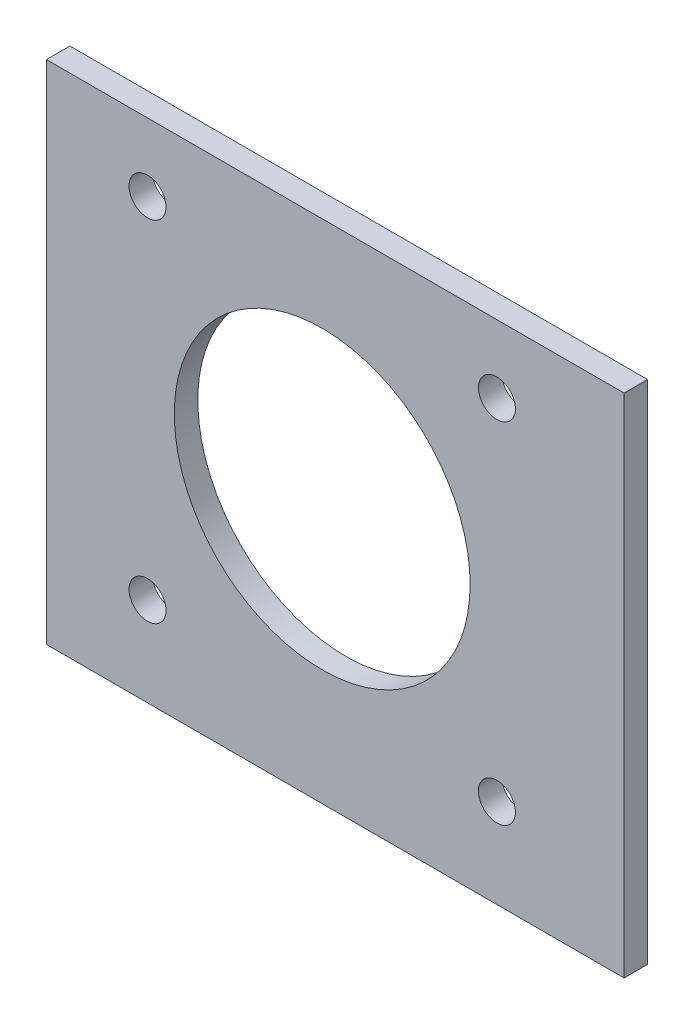
ISO-10303-21;
HEADER;
FILE_DESCRIPTION(('STEP AP214'),'2;1');
FILE_NAME('part.step','',(''),(''),'','','');
FILE_SCHEMA(('AUTOMOTIVE_DESIGN { 1 0 10303 214 1 1 1 1 }'));
ENDSEC;
DATA;
#1=APPLICATION_CONTEXT('core data for automotive mechanical design processes');
#2=APPLICATION_PROTOCOL_DEFINITION('international standard','automotive_design',2000,#1);
#3=PRODUCT_CONTEXT('',#1,'mechanical');
#4=PRODUCT('Part','Part','',(#3));
#5=PRODUCT_RELATED_PRODUCT_CATEGORY('part','',(#4));
#6=PRODUCT_DEFINITION_FORMATION('','',#4);
#7=PRODUCT_DEFINITION_CONTEXT('part definition',#1,'design');
#8=PRODUCT_DEFINITION('design','',#6,#7);
#9=PRODUCT_DEFINITION_SHAPE('','',#8);
#10=(LENGTH_UNIT() NAMED_UNIT(*) SI_UNIT(.MILLI.,.METRE.));
#11=(NAMED_UNIT(*) PLANE_ANGLE_UNIT() SI_UNIT($,.RADIAN.));
#12=(NAMED_UNIT(*) SI_UNIT($,.STERADIAN.) SOLID_ANGLE_UNIT());
#13=UNCERTAINTY_MEASURE_WITH_UNIT(LENGTH_MEASURE(1.E-05),#10,'distance_accuracy_value','');
#14=(GEOMETRIC_REPRESENTATION_CONTEXT(3) GLOBAL_UNCERTAINTY_ASSIGNED_CONTEXT((#13)) GLOBAL_UNIT_ASSIGNED_CONTEXT((#10,
#11,#12)) REPRESENTATION_CONTEXT('',''));
#15=CARTESIAN_POINT('',(0.,0.,0.));
#16=DIRECTION('',(0.,0.,1.));
#17=DIRECTION('',(1.,0.,0.));
#18=AXIS2_PLACEMENT_3D('',#15,#16,#17);
#19=CARTESIAN_POINT('',(-37.2955274692117,-35.6729857622042,3.175));
#20=DIRECTION('',(0.,0.,1.));
#21=DIRECTION('',(1.,0.,0.));
#22=AXIS2_PLACEMENT_3D('',#19,#20,#21);
#23=PLANE('',#22);
#24=CARTESIAN_POINT('',(-23.622,-23.622,3.175));
#25=DIRECTION('',(0.,0.,1.));
#26=DIRECTION('',(1.,0.,0.));
#27=AXIS2_PLACEMENT_3D('',#24,#25,#26);
#28=CIRCLE('',#27,2.5);
#29=CARTESIAN_POINT('',(-21.122,-23.622,3.175));
#30=VERTEX_POINT('',#29);
#31=EDGE_CURVE('E127',#30,#30,#28,.T.);
#32=ORIENTED_EDGE('',*,*,#31,.F.);
#33=EDGE_LOOP('',(#32));
#34=FACE_BOUND('',#33,.T.);
#35=CARTESIAN_POINT('',(-23.622,23.622,3.175));
#36=DIRECTION('',(0.,0.,1.));
#37=DIRECTION('',(1.,0.,0.));
#38=AXIS2_PLACEMENT_3D('',#35,#36,#37);
#39=CIRCLE('',#38,2.5);
#40=CARTESIAN_POINT('',(-21.122,23.622,3.175));
#41=VERTEX_POINT('',#40);
#42=EDGE_CURVE('E115',#41,#41,#39,.T.);
#43=ORIENTED_EDGE('',*,*,#42,.F.);
#44=EDGE_LOOP('',(#43));
#45=FACE_BOUND('',#44,.T.);
#46=DIRECTION('',(0.,-1.,0.));
#47=VECTOR('',#46,1.);
#48=CARTESIAN_POINT('',(-37.2955274692117,32.8191971347565,3.175));
#49=LINE('',#48,#47);
#50=CARTESIAN_POINT('',(-37.2955274692117,32.8191971347565,3.175));
#51=VERTEX_POINT('',#50);
#52=CARTESIAN_POINT('',(-37.2955274692117,-35.6729857622042,3.175));
#53=VERTEX_POINT('',#52);
#54=EDGE_CURVE('E85',#51,#53,#49,.T.);
#55=ORIENTED_EDGE('',*,*,#54,.T.);
#56=DIRECTION('',(1.,0.,0.));
#57=VECTOR('',#56,1.);
#58=CARTESIAN_POINT('',(-37.2955274692117,-35.6729857622042,3.175));
#59=LINE('',#58,#57);
#60=CARTESIAN_POINT('',(40.821549654197,-35.6729857622042,3.175));
#61=VERTEX_POINT('',#60);
#62=EDGE_CURVE('E80',#53,#61,#59,.T.);
#63=ORIENTED_EDGE('',*,*,#62,.T.);
#64=DIRECTION('',(0.,1.,0.));
#65=VECTOR('',#64,1.);
#66=CARTESIAN_POINT('',(40.821549654197,32.8191971347565,3.175));
#67=LINE('',#66,#65);
#68=CARTESIAN_POINT('',(40.821549654197,32.8191971347565,3.175));
#69=VERTEX_POINT('',#68);
#70=EDGE_CURVE('E83',#61,#69,#67,.T.);
#71=ORIENTED_EDGE('',*,*,#70,.T.);
#72=DIRECTION('',(-1.,0.,0.));
#73=VECTOR('',#72,1.);
#74=CARTESIAN_POINT('',(-37.2955274692117,32.8191971347565,3.175));
#75=LINE('',#74,#73);
#76=EDGE_CURVE('E50',#69,#51,#75,.T.);
#77=ORIENTED_EDGE('',*,*,#76,.T.);
#78=EDGE_LOOP('',(#55,#63,#71,#77));
#79=FACE_BOUND('',#78,.T.);
#80=CARTESIAN_POINT('',(0.,0.,3.175));
#81=DIRECTION('',(0.,0.,1.));
#82=DIRECTION('',(1.,0.,0.));
#83=AXIS2_PLACEMENT_3D('',#80,#81,#82);
#84=CIRCLE('',#83,20.);
#85=CARTESIAN_POINT('',(20.,0.,3.175));
#86=VERTEX_POINT('',#85);
#87=EDGE_CURVE('E100',#86,#86,#84,.T.);
#88=ORIENTED_EDGE('',*,*,#87,.F.);
#89=EDGE_LOOP('',(#88));
#90=FACE_BOUND('',#89,.T.);
#91=CARTESIAN_POINT('',(23.622,23.622,3.175));
#92=DIRECTION('',(0.,0.,1.));
#93=DIRECTION('',(1.,0.,0.));
#94=AXIS2_PLACEMENT_3D('',#91,#92,#93);
#95=CIRCLE('',#94,2.5);
#96=CARTESIAN_POINT('',(26.122,23.622,3.175));
#97=VERTEX_POINT('',#96);
#98=EDGE_CURVE('E121',#97,#97,#95,.T.);
#99=ORIENTED_EDGE('',*,*,#98,.F.);
#100=EDGE_LOOP('',(#99));
#101=FACE_BOUND('',#100,.T.);
#102=CARTESIAN_POINT('',(23.622,-23.622,3.175));
#103=DIRECTION('',(0.,0.,1.));
#104=DIRECTION('',(1.,0.,0.));
#105=AXIS2_PLACEMENT_3D('',#102,#103,#104);
#106=CIRCLE('',#105,2.5);
#107=CARTESIAN_POINT('',(26.122,-23.622,3.175));
#108=VERTEX_POINT('',#107);
#109=EDGE_CURVE('E133',#108,#108,#106,.T.);
#110=ORIENTED_EDGE('',*,*,#109,.F.);
#111=EDGE_LOOP('',(#110));
#112=FACE_BOUND('',#111,.T.);
#113=ADVANCED_FACE('F33',(#34,#45,#79,#90,#101,#112),#23,.T.);
#114=CARTESIAN_POINT('',(-37.2955274692117,-35.6729857622042,0.));
#115=DIRECTION('',(0.,0.,1.));
#116=DIRECTION('',(1.,0.,0.));
#117=AXIS2_PLACEMENT_3D('',#114,#115,#116);
#118=PLANE('',#117);
#119=CARTESIAN_POINT('',(-23.622,-23.622,0.));
#120=DIRECTION('',(0.,0.,1.));
#121=DIRECTION('',(1.,0.,0.));
#122=AXIS2_PLACEMENT_3D('',#119,#120,#121);
#123=CIRCLE('',#122,2.5);
#124=CARTESIAN_POINT('',(-21.122,-23.622,0.));
#125=VERTEX_POINT('',#124);
#126=EDGE_CURVE('E130',#125,#125,#123,.T.);
#127=ORIENTED_EDGE('',*,*,#126,.T.);
#128=EDGE_LOOP('',(#127));
#129=FACE_BOUND('',#128,.T.);
#130=CARTESIAN_POINT('',(-23.622,23.622,0.));
#131=DIRECTION('',(0.,0.,1.));
#132=DIRECTION('',(1.,0.,0.));
#133=AXIS2_PLACEMENT_3D('',#130,#131,#132);
#134=CIRCLE('',#133,2.5);
#135=CARTESIAN_POINT('',(-21.122,23.622,0.));
#136=VERTEX_POINT('',#135);
#137=EDGE_CURVE('E118',#136,#136,#134,.T.);
#138=ORIENTED_EDGE('',*,*,#137,.T.);
#139=EDGE_LOOP('',(#138));
#140=FACE_BOUND('',#139,.T.);
#141=DIRECTION('',(0.,-1.,0.));
#142=VECTOR('',#141,1.);
#143=CARTESIAN_POINT('',(-37.2955274692117,32.8191971347565,0.));
#144=LINE('',#143,#142);
#145=CARTESIAN_POINT('',(-37.2955274692117,32.8191971347565,0.));
#146=VERTEX_POINT('',#145);
#147=CARTESIAN_POINT('',(-37.2955274692117,-35.6729857622042,0.));
#148=VERTEX_POINT('',#147);
#149=EDGE_CURVE('E97',#146,#148,#144,.T.);
#150=ORIENTED_EDGE('',*,*,#149,.F.);
#151=DIRECTION('',(-1.,0.,0.));
#152=VECTOR('',#151,1.);
#153=CARTESIAN_POINT('',(-37.2955274692117,32.8191971347565,0.));
#154=LINE('',#153,#152);
#155=CARTESIAN_POINT('',(40.821549654197,32.8191971347565,0.));
#156=VERTEX_POINT('',#155);
#157=EDGE_CURVE('E73',#156,#146,#154,.T.);
#158=ORIENTED_EDGE('',*,*,#157,.F.);
#159=DIRECTION('',(0.,1.,0.));
#160=VECTOR('',#159,1.);
#161=CARTESIAN_POINT('',(40.821549654197,32.8191971347565,0.));
#162=LINE('',#161,#160);
#163=CARTESIAN_POINT('',(40.821549654197,-35.6729857622042,0.));
#164=VERTEX_POINT('',#163);
#165=EDGE_CURVE('E67',#164,#156,#162,.T.);
#166=ORIENTED_EDGE('',*,*,#165,.F.);
#167=DIRECTION('',(1.,0.,0.));
#168=VECTOR('',#167,1.);
#169=CARTESIAN_POINT('',(-37.2955274692117,-35.6729857622042,0.));
#170=LINE('',#169,#168);
#171=EDGE_CURVE('E89',#148,#164,#170,.T.);
#172=ORIENTED_EDGE('',*,*,#171,.F.);
#173=EDGE_LOOP('',(#150,#158,#166,#172));
#174=FACE_BOUND('',#173,.T.);
#175=CARTESIAN_POINT('',(0.,0.,0.));
#176=DIRECTION('',(0.,0.,1.));
#177=DIRECTION('',(1.,0.,0.));
#178=AXIS2_PLACEMENT_3D('',#175,#176,#177);
#179=CIRCLE('',#178,20.);
#180=CARTESIAN_POINT('',(20.,0.,0.));
#181=VERTEX_POINT('',#180);
#182=EDGE_CURVE('E112',#181,#181,#179,.T.);
#183=ORIENTED_EDGE('',*,*,#182,.T.);
#184=EDGE_LOOP('',(#183));
#185=FACE_BOUND('',#184,.T.);
#186=CARTESIAN_POINT('',(23.622,23.622,0.));
#187=DIRECTION('',(0.,0.,1.));
#188=DIRECTION('',(1.,0.,0.));
#189=AXIS2_PLACEMENT_3D('',#186,#187,#188);
#190=CIRCLE('',#189,2.5);
#191=CARTESIAN_POINT('',(26.122,23.622,0.));
#192=VERTEX_POINT('',#191);
#193=EDGE_CURVE('E124',#192,#192,#190,.T.);
#194=ORIENTED_EDGE('',*,*,#193,.T.);
#195=EDGE_LOOP('',(#194));
#196=FACE_BOUND('',#195,.T.);
#197=CARTESIAN_POINT('',(23.622,-23.622,0.));
#198=DIRECTION('',(0.,0.,1.));
#199=DIRECTION('',(1.,0.,0.));
#200=AXIS2_PLACEMENT_3D('',#197,#198,#199);
#201=CIRCLE('',#200,2.5);
#202=CARTESIAN_POINT('',(26.122,-23.622,0.));
#203=VERTEX_POINT('',#202);
#204=EDGE_CURVE('E136',#203,#203,#201,.T.);
#205=ORIENTED_EDGE('',*,*,#204,.T.);
#206=EDGE_LOOP('',(#205));
#207=FACE_BOUND('',#206,.T.);
#208=ADVANCED_FACE('F108',(#129,#140,#174,#185,#196,#207),#118,.F.);
#209=CARTESIAN_POINT('',(-37.2955274692117,32.8191971347565,3.175));
#210=DIRECTION('',(1.,0.,0.));
#211=DIRECTION('',(0.,0.,-1.));
#212=AXIS2_PLACEMENT_3D('',#209,#210,#211);
#213=PLANE('',#212);
#214=ORIENTED_EDGE('',*,*,#149,.T.);
#215=DIRECTION('',(0.,0.,-1.));
#216=VECTOR('',#215,1.);
#217=CARTESIAN_POINT('',(-37.2955274692117,-35.6729857622042,3.175));
#218=LINE('',#217,#216);
#219=EDGE_CURVE('E11',#53,#148,#218,.T.);
#220=ORIENTED_EDGE('',*,*,#219,.F.);
#221=ORIENTED_EDGE('',*,*,#54,.F.);
#222=DIRECTION('',(0.,0.,-1.));
#223=VECTOR('',#222,1.);
#224=CARTESIAN_POINT('',(-37.2955274692117,32.8191971347565,3.175));
#225=LINE('',#224,#223);
#226=EDGE_CURVE('E93',#51,#146,#225,.T.);
#227=ORIENTED_EDGE('',*,*,#226,.T.);
#228=EDGE_LOOP('',(#214,#220,#221,#227));
#229=FACE_BOUND('',#228,.T.);
#230=ADVANCED_FACE('F35',(#229),#213,.F.);
#231=CARTESIAN_POINT('',(-37.2955274692117,-35.6729857622042,3.175));
#232=DIRECTION('',(0.,1.,0.));
#233=DIRECTION('',(0.,0.,1.));
#234=AXIS2_PLACEMENT_3D('',#231,#232,#233);
#235=PLANE('',#234);
#236=ORIENTED_EDGE('',*,*,#171,.T.);
#237=DIRECTION('',(0.,0.,-1.));
#238=VECTOR('',#237,1.);
#239=CARTESIAN_POINT('',(40.821549654197,-35.6729857622042,3.175));
#240=LINE('',#239,#238);
#241=EDGE_CURVE('E42',#61,#164,#240,.T.);
#242=ORIENTED_EDGE('',*,*,#241,.F.);
#243=ORIENTED_EDGE('',*,*,#62,.F.);
#244=ORIENTED_EDGE('',*,*,#219,.T.);
#245=EDGE_LOOP('',(#236,#242,#243,#244));
#246=FACE_BOUND('',#245,.T.);
#247=ADVANCED_FACE('F88',(#246),#235,.F.);
#248=CARTESIAN_POINT('',(40.821549654197,32.8191971347565,3.175));
#249=DIRECTION('',(-1.,0.,0.));
#250=DIRECTION('',(0.,0.,1.));
#251=AXIS2_PLACEMENT_3D('',#248,#249,#250);
#252=PLANE('',#251);
#253=ORIENTED_EDGE('',*,*,#165,.T.);
#254=DIRECTION('',(0.,0.,-1.));
#255=VECTOR('',#254,1.);
#256=CARTESIAN_POINT('',(40.821549654197,32.8191971347565,3.175));
#257=LINE('',#256,#255);
#258=EDGE_CURVE('E90',#69,#156,#257,.T.);
#259=ORIENTED_EDGE('',*,*,#258,.F.);
#260=ORIENTED_EDGE('',*,*,#70,.F.);
#261=ORIENTED_EDGE('',*,*,#241,.T.);
#262=EDGE_LOOP('',(#253,#259,#260,#261));
#263=FACE_BOUND('',#262,.T.);
#264=ADVANCED_FACE('F91',(#263),#252,.F.);
#265=CARTESIAN_POINT('',(-37.2955274692117,32.8191971347565,3.175));
#266=DIRECTION('',(0.,-1.,0.));
#267=DIRECTION('',(0.,0.,-1.));
#268=AXIS2_PLACEMENT_3D('',#265,#266,#267);
#269=PLANE('',#268);
#270=ORIENTED_EDGE('',*,*,#157,.T.);
#271=ORIENTED_EDGE('',*,*,#226,.F.);
#272=ORIENTED_EDGE('',*,*,#76,.F.);
#273=ORIENTED_EDGE('',*,*,#258,.T.);
#274=EDGE_LOOP('',(#270,#271,#272,#273));
#275=FACE_BOUND('',#274,.T.);
#276=ADVANCED_FACE('F105',(#275),#269,.F.);
#277=CARTESIAN_POINT('',(0.,0.,3.175));
#278=DIRECTION('',(0.,0.,-1.));
#279=DIRECTION('',(-1.,0.,0.));
#280=AXIS2_PLACEMENT_3D('',#277,#278,#279);
#281=CYLINDRICAL_SURFACE('',#280,20.);
#282=ORIENTED_EDGE('',*,*,#87,.T.);
#283=EDGE_LOOP('',(#282));
#284=FACE_BOUND('',#283,.T.);
#285=ORIENTED_EDGE('',*,*,#182,.F.);
#286=EDGE_LOOP('',(#285));
#287=FACE_BOUND('',#286,.T.);
#288=ADVANCED_FACE('F156',(#284,#287),#281,.F.);
#289=CARTESIAN_POINT('',(-23.622,23.622,3.175));
#290=DIRECTION('',(0.,0.,-1.));
#291=DIRECTION('',(-1.,0.,0.));
#292=AXIS2_PLACEMENT_3D('',#289,#290,#291);
#293=CYLINDRICAL_SURFACE('',#292,2.5);
#294=ORIENTED_EDGE('',*,*,#42,.T.);
#295=EDGE_LOOP('',(#294));
#296=FACE_BOUND('',#295,.T.);
#297=ORIENTED_EDGE('',*,*,#137,.F.);
#298=EDGE_LOOP('',(#297));
#299=FACE_BOUND('',#298,.T.);
#300=ADVANCED_FACE('F210',(#296,#299),#293,.F.);
#301=CARTESIAN_POINT('',(23.622,23.622,3.175));
#302=DIRECTION('',(0.,0.,-1.));
#303=DIRECTION('',(-1.,0.,0.));
#304=AXIS2_PLACEMENT_3D('',#301,#302,#303);
#305=CYLINDRICAL_SURFACE('',#304,2.5);
#306=ORIENTED_EDGE('',*,*,#98,.T.);
#307=EDGE_LOOP('',(#306));
#308=FACE_BOUND('',#307,.T.);
#309=ORIENTED_EDGE('',*,*,#193,.F.);
#310=EDGE_LOOP('',(#309));
#311=FACE_BOUND('',#310,.T.);
#312=ADVANCED_FACE('F219',(#308,#311),#305,.F.);
#313=CARTESIAN_POINT('',(-23.622,-23.622,3.175));
#314=DIRECTION('',(0.,0.,-1.));
#315=DIRECTION('',(-1.,0.,0.));
#316=AXIS2_PLACEMENT_3D('',#313,#314,#315);
#317=CYLINDRICAL_SURFACE('',#316,2.5);
#318=ORIENTED_EDGE('',*,*,#31,.T.);
#319=EDGE_LOOP('',(#318));
#320=FACE_BOUND('',#319,.T.);
#321=ORIENTED_EDGE('',*,*,#126,.F.);
#322=EDGE_LOOP('',(#321));
#323=FACE_BOUND('',#322,.T.);
#324=ADVANCED_FACE('F228',(#320,#323),#317,.F.);
#325=CARTESIAN_POINT('',(23.622,-23.622,3.175));
#326=DIRECTION('',(0.,0.,-1.));
#327=DIRECTION('',(-1.,0.,0.));
#328=AXIS2_PLACEMENT_3D('',#325,#326,#327);
#329=CYLINDRICAL_SURFACE('',#328,2.5);
#330=ORIENTED_EDGE('',*,*,#109,.T.);
#331=EDGE_LOOP('',(#330));
#332=FACE_BOUND('',#331,.T.);
#333=ORIENTED_EDGE('',*,*,#204,.F.);
#334=EDGE_LOOP('',(#333));
#335=FACE_BOUND('',#334,.T.);
#336=ADVANCED_FACE('F142',(#332,#335),#329,.F.);
#337=CLOSED_SHELL('',(#113,#208,#230,#247,#264,#276,#288,#300,#312,#324,#336));
#338=MANIFOLD_SOLID_BREP('B2',#337);
#339=ADVANCED_BREP_SHAPE_REPRESENTATION('',(#18,#338),#14);
#340=SHAPE_DEFINITION_REPRESENTATION(#9,#339);
ENDSEC;
END-ISO-10303-21;
